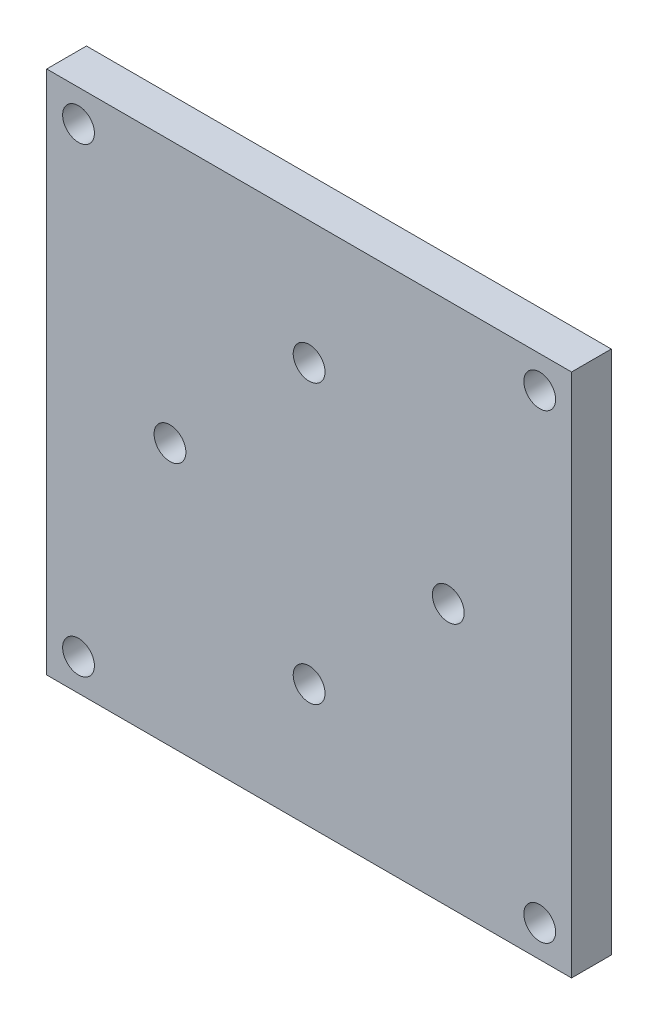
ISO-10303-21;
HEADER;
FILE_DESCRIPTION(('STEP AP214'),'2;1');
FILE_NAME('part.step','',(''),(''),'','','');
FILE_SCHEMA(('AUTOMOTIVE_DESIGN { 1 0 10303 214 1 1 1 1 }'));
ENDSEC;
DATA;
#1=APPLICATION_CONTEXT('core data for automotive mechanical design processes');
#2=APPLICATION_PROTOCOL_DEFINITION('international standard','automotive_design',2000,#1);
#3=PRODUCT_CONTEXT('',#1,'mechanical');
#4=PRODUCT('Part','Part','',(#3));
#5=PRODUCT_RELATED_PRODUCT_CATEGORY('part','',(#4));
#6=PRODUCT_DEFINITION_FORMATION('','',#4);
#7=PRODUCT_DEFINITION_CONTEXT('part definition',#1,'design');
#8=PRODUCT_DEFINITION('design','',#6,#7);
#9=PRODUCT_DEFINITION_SHAPE('','',#8);
#10=(LENGTH_UNIT() NAMED_UNIT(*) SI_UNIT(.MILLI.,.METRE.));
#11=(NAMED_UNIT(*) PLANE_ANGLE_UNIT() SI_UNIT($,.RADIAN.));
#12=(NAMED_UNIT(*) SI_UNIT($,.STERADIAN.) SOLID_ANGLE_UNIT());
#13=UNCERTAINTY_MEASURE_WITH_UNIT(LENGTH_MEASURE(1.E-05),#10,'distance_accuracy_value','');
#14=(GEOMETRIC_REPRESENTATION_CONTEXT(3) GLOBAL_UNCERTAINTY_ASSIGNED_CONTEXT((#13)) GLOBAL_UNIT_ASSIGNED_CONTEXT((#10,
#11,#12)) REPRESENTATION_CONTEXT('',''));
#15=CARTESIAN_POINT('',(0.,0.,0.));
#16=DIRECTION('',(0.,0.,1.));
#17=DIRECTION('',(1.,0.,0.));
#18=AXIS2_PLACEMENT_3D('',#15,#16,#17);
#19=CARTESIAN_POINT('',(33.,-33.,2.5));
#20=DIRECTION('',(-1.,0.,0.));
#21=DIRECTION('',(0.,0.,1.));
#22=AXIS2_PLACEMENT_3D('',#19,#20,#21);
#23=PLANE('',#22);
#24=DIRECTION('',(0.,1.,0.));
#25=VECTOR('',#24,1.);
#26=CARTESIAN_POINT('',(33.,-33.,-2.5));
#27=LINE('',#26,#25);
#28=CARTESIAN_POINT('',(33.,-33.,-2.5));
#29=VERTEX_POINT('',#28);
#30=CARTESIAN_POINT('',(33.,33.,-2.5));
#31=VERTEX_POINT('',#30);
#32=EDGE_CURVE('E107',#29,#31,#27,.T.);
#33=ORIENTED_EDGE('',*,*,#32,.T.);
#34=DIRECTION('',(0.,0.,-1.));
#35=VECTOR('',#34,1.);
#36=CARTESIAN_POINT('',(33.,33.,2.5));
#37=LINE('',#36,#35);
#38=CARTESIAN_POINT('',(33.,33.,2.5));
#39=VERTEX_POINT('',#38);
#40=EDGE_CURVE('E11',#39,#31,#37,.T.);
#41=ORIENTED_EDGE('',*,*,#40,.F.);
#42=DIRECTION('',(0.,1.,0.));
#43=VECTOR('',#42,1.);
#44=CARTESIAN_POINT('',(33.,-33.,2.5));
#45=LINE('',#44,#43);
#46=CARTESIAN_POINT('',(33.,-33.,2.5));
#47=VERTEX_POINT('',#46);
#48=EDGE_CURVE('E91',#47,#39,#45,.T.);
#49=ORIENTED_EDGE('',*,*,#48,.F.);
#50=DIRECTION('',(0.,0.,-1.));
#51=VECTOR('',#50,1.);
#52=CARTESIAN_POINT('',(33.,-33.,2.5));
#53=LINE('',#52,#51);
#54=EDGE_CURVE('E103',#47,#29,#53,.T.);
#55=ORIENTED_EDGE('',*,*,#54,.T.);
#56=EDGE_LOOP('',(#33,#41,#49,#55));
#57=FACE_BOUND('',#56,.T.);
#58=ADVANCED_FACE('F39',(#57),#23,.F.);
#59=CARTESIAN_POINT('',(-33.,33.,2.5));
#60=DIRECTION('',(0.,-1.,0.));
#61=DIRECTION('',(0.,0.,-1.));
#62=AXIS2_PLACEMENT_3D('',#59,#60,#61);
#63=PLANE('',#62);
#64=DIRECTION('',(-1.,0.,0.));
#65=VECTOR('',#64,1.);
#66=CARTESIAN_POINT('',(-33.,33.,-2.5));
#67=LINE('',#66,#65);
#68=CARTESIAN_POINT('',(-33.,33.,-2.5));
#69=VERTEX_POINT('',#68);
#70=EDGE_CURVE('E96',#31,#69,#67,.T.);
#71=ORIENTED_EDGE('',*,*,#70,.T.);
#72=DIRECTION('',(0.,0.,-1.));
#73=VECTOR('',#72,1.);
#74=CARTESIAN_POINT('',(-33.,33.,2.5));
#75=LINE('',#74,#73);
#76=CARTESIAN_POINT('',(-33.,33.,2.5));
#77=VERTEX_POINT('',#76);
#78=EDGE_CURVE('E48',#77,#69,#75,.T.);
#79=ORIENTED_EDGE('',*,*,#78,.F.);
#80=DIRECTION('',(-1.,0.,0.));
#81=VECTOR('',#80,1.);
#82=CARTESIAN_POINT('',(-33.,33.,2.5));
#83=LINE('',#82,#81);
#84=EDGE_CURVE('E86',#39,#77,#83,.T.);
#85=ORIENTED_EDGE('',*,*,#84,.F.);
#86=ORIENTED_EDGE('',*,*,#40,.T.);
#87=EDGE_LOOP('',(#71,#79,#85,#86));
#88=FACE_BOUND('',#87,.T.);
#89=ADVANCED_FACE('F95',(#88),#63,.F.);
#90=CARTESIAN_POINT('',(-33.,-33.,2.5));
#91=DIRECTION('',(1.,0.,0.));
#92=DIRECTION('',(0.,0.,-1.));
#93=AXIS2_PLACEMENT_3D('',#90,#91,#92);
#94=PLANE('',#93);
#95=DIRECTION('',(0.,-1.,0.));
#96=VECTOR('',#95,1.);
#97=CARTESIAN_POINT('',(-33.,-33.,-2.5));
#98=LINE('',#97,#96);
#99=CARTESIAN_POINT('',(-33.,-33.,-2.5));
#100=VERTEX_POINT('',#99);
#101=EDGE_CURVE('E73',#69,#100,#98,.T.);
#102=ORIENTED_EDGE('',*,*,#101,.T.);
#103=DIRECTION('',(0.,0.,-1.));
#104=VECTOR('',#103,1.);
#105=CARTESIAN_POINT('',(-33.,-33.,2.5));
#106=LINE('',#105,#104);
#107=CARTESIAN_POINT('',(-33.,-33.,2.5));
#108=VERTEX_POINT('',#107);
#109=EDGE_CURVE('E98',#108,#100,#106,.T.);
#110=ORIENTED_EDGE('',*,*,#109,.F.);
#111=DIRECTION('',(0.,-1.,0.));
#112=VECTOR('',#111,1.);
#113=CARTESIAN_POINT('',(-33.,-33.,2.5));
#114=LINE('',#113,#112);
#115=EDGE_CURVE('E89',#77,#108,#114,.T.);
#116=ORIENTED_EDGE('',*,*,#115,.F.);
#117=ORIENTED_EDGE('',*,*,#78,.T.);
#118=EDGE_LOOP('',(#102,#110,#116,#117));
#119=FACE_BOUND('',#118,.T.);
#120=ADVANCED_FACE('F99',(#119),#94,.F.);
#121=CARTESIAN_POINT('',(-33.,-33.,2.5));
#122=DIRECTION('',(0.,1.,0.));
#123=DIRECTION('',(0.,0.,1.));
#124=AXIS2_PLACEMENT_3D('',#121,#122,#123);
#125=PLANE('',#124);
#126=DIRECTION('',(1.,0.,0.));
#127=VECTOR('',#126,1.);
#128=CARTESIAN_POINT('',(-33.,-33.,-2.5));
#129=LINE('',#128,#127);
#130=EDGE_CURVE('E79',#100,#29,#129,.T.);
#131=ORIENTED_EDGE('',*,*,#130,.T.);
#132=ORIENTED_EDGE('',*,*,#54,.F.);
#133=DIRECTION('',(1.,0.,0.));
#134=VECTOR('',#133,1.);
#135=CARTESIAN_POINT('',(-33.,-33.,2.5));
#136=LINE('',#135,#134);
#137=EDGE_CURVE('E56',#108,#47,#136,.T.);
#138=ORIENTED_EDGE('',*,*,#137,.F.);
#139=ORIENTED_EDGE('',*,*,#109,.T.);
#140=EDGE_LOOP('',(#131,#132,#138,#139));
#141=FACE_BOUND('',#140,.T.);
#142=ADVANCED_FACE('F121',(#141),#125,.F.);
#143=CARTESIAN_POINT('',(0.,0.,2.5));
#144=DIRECTION('',(0.,0.,-1.));
#145=DIRECTION('',(-1.,0.,0.));
#146=AXIS2_PLACEMENT_3D('',#143,#144,#145);
#147=PLANE('',#146);
#148=CARTESIAN_POINT('',(0.,17.5,2.5));
#149=DIRECTION('',(0.,0.,1.));
#150=DIRECTION('',(1.,0.,0.));
#151=AXIS2_PLACEMENT_3D('',#148,#149,#150);
#152=CIRCLE('',#151,2.);
#153=CARTESIAN_POINT('',(2.,17.5,2.5));
#154=VERTEX_POINT('',#153);
#155=EDGE_CURVE('E184',#154,#154,#152,.T.);
#156=ORIENTED_EDGE('',*,*,#155,.F.);
#157=EDGE_LOOP('',(#156));
#158=FACE_BOUND('',#157,.T.);
#159=CARTESIAN_POINT('',(17.5,0.,2.5));
#160=DIRECTION('',(0.,0.,1.));
#161=DIRECTION('',(1.,0.,0.));
#162=AXIS2_PLACEMENT_3D('',#159,#160,#161);
#163=CIRCLE('',#162,2.);
#164=CARTESIAN_POINT('',(19.5,0.,2.5));
#165=VERTEX_POINT('',#164);
#166=EDGE_CURVE('E176',#165,#165,#163,.T.);
#167=ORIENTED_EDGE('',*,*,#166,.F.);
#168=EDGE_LOOP('',(#167));
#169=FACE_BOUND('',#168,.T.);
#170=CARTESIAN_POINT('',(0.,-17.5,2.5));
#171=DIRECTION('',(0.,0.,1.));
#172=DIRECTION('',(1.,0.,0.));
#173=AXIS2_PLACEMENT_3D('',#170,#171,#172);
#174=CIRCLE('',#173,2.);
#175=CARTESIAN_POINT('',(2.,-17.5,2.5));
#176=VERTEX_POINT('',#175);
#177=EDGE_CURVE('E168',#176,#176,#174,.T.);
#178=ORIENTED_EDGE('',*,*,#177,.F.);
#179=EDGE_LOOP('',(#178));
#180=FACE_BOUND('',#179,.T.);
#181=CARTESIAN_POINT('',(-17.5,0.,2.5));
#182=DIRECTION('',(0.,0.,1.));
#183=DIRECTION('',(1.,0.,0.));
#184=AXIS2_PLACEMENT_3D('',#181,#182,#183);
#185=CIRCLE('',#184,2.);
#186=CARTESIAN_POINT('',(-15.5,0.,2.5));
#187=VERTEX_POINT('',#186);
#188=EDGE_CURVE('E160',#187,#187,#185,.T.);
#189=ORIENTED_EDGE('',*,*,#188,.F.);
#190=EDGE_LOOP('',(#189));
#191=FACE_BOUND('',#190,.T.);
#192=CARTESIAN_POINT('',(-29.,-29.,2.5));
#193=DIRECTION('',(0.,0.,1.));
#194=DIRECTION('',(1.,0.,0.));
#195=AXIS2_PLACEMENT_3D('',#192,#193,#194);
#196=CIRCLE('',#195,2.);
#197=CARTESIAN_POINT('',(-27.,-29.,2.5));
#198=VERTEX_POINT('',#197);
#199=EDGE_CURVE('E136',#198,#198,#196,.T.);
#200=ORIENTED_EDGE('',*,*,#199,.F.);
#201=EDGE_LOOP('',(#200));
#202=FACE_BOUND('',#201,.T.);
#203=CARTESIAN_POINT('',(29.,-29.,2.5));
#204=DIRECTION('',(0.,0.,1.));
#205=DIRECTION('',(1.,0.,0.));
#206=AXIS2_PLACEMENT_3D('',#203,#204,#205);
#207=CIRCLE('',#206,2.00000000000001);
#208=CARTESIAN_POINT('',(31.,-29.,2.5));
#209=VERTEX_POINT('',#208);
#210=EDGE_CURVE('E145',#209,#209,#207,.T.);
#211=ORIENTED_EDGE('',*,*,#210,.F.);
#212=EDGE_LOOP('',(#211));
#213=FACE_BOUND('',#212,.T.);
#214=CARTESIAN_POINT('',(29.,29.,2.5));
#215=DIRECTION('',(0.,0.,1.));
#216=DIRECTION('',(1.,0.,0.));
#217=AXIS2_PLACEMENT_3D('',#214,#215,#216);
#218=CIRCLE('',#217,2.00000000000001);
#219=CARTESIAN_POINT('',(31.,29.,2.5));
#220=VERTEX_POINT('',#219);
#221=EDGE_CURVE('E153',#220,#220,#218,.T.);
#222=ORIENTED_EDGE('',*,*,#221,.F.);
#223=EDGE_LOOP('',(#222));
#224=FACE_BOUND('',#223,.T.);
#225=CARTESIAN_POINT('',(-29.,29.,2.5));
#226=DIRECTION('',(0.,0.,1.));
#227=DIRECTION('',(1.,0.,0.));
#228=AXIS2_PLACEMENT_3D('',#225,#226,#227);
#229=CIRCLE('',#228,2.);
#230=CARTESIAN_POINT('',(-27.,29.,2.5));
#231=VERTEX_POINT('',#230);
#232=EDGE_CURVE('E128',#231,#231,#229,.T.);
#233=ORIENTED_EDGE('',*,*,#232,.F.);
#234=EDGE_LOOP('',(#233));
#235=FACE_BOUND('',#234,.T.);
#236=ORIENTED_EDGE('',*,*,#48,.T.);
#237=ORIENTED_EDGE('',*,*,#84,.T.);
#238=ORIENTED_EDGE('',*,*,#115,.T.);
#239=ORIENTED_EDGE('',*,*,#137,.T.);
#240=EDGE_LOOP('',(#236,#237,#238,#239));
#241=FACE_BOUND('',#240,.T.);
#242=ADVANCED_FACE('F87',(#158,#169,#180,#191,#202,#213,#224,#235,#241),#147,.F.);
#243=CARTESIAN_POINT('',(0.,0.,-2.5));
#244=DIRECTION('',(0.,0.,-1.));
#245=DIRECTION('',(-1.,0.,0.));
#246=AXIS2_PLACEMENT_3D('',#243,#244,#245);
#247=PLANE('',#246);
#248=CARTESIAN_POINT('',(0.,17.5,-2.5));
#249=DIRECTION('',(0.,0.,1.));
#250=DIRECTION('',(1.,0.,0.));
#251=AXIS2_PLACEMENT_3D('',#248,#249,#250);
#252=CIRCLE('',#251,2.);
#253=CARTESIAN_POINT('',(2.,17.5,-2.5));
#254=VERTEX_POINT('',#253);
#255=EDGE_CURVE('E141',#254,#254,#252,.T.);
#256=ORIENTED_EDGE('',*,*,#255,.T.);
#257=EDGE_LOOP('',(#256));
#258=FACE_BOUND('',#257,.T.);
#259=CARTESIAN_POINT('',(17.5,0.,-2.5));
#260=DIRECTION('',(0.,0.,1.));
#261=DIRECTION('',(1.,0.,0.));
#262=AXIS2_PLACEMENT_3D('',#259,#260,#261);
#263=CIRCLE('',#262,2.);
#264=CARTESIAN_POINT('',(19.5,0.,-2.5));
#265=VERTEX_POINT('',#264);
#266=EDGE_CURVE('E180',#265,#265,#263,.T.);
#267=ORIENTED_EDGE('',*,*,#266,.T.);
#268=EDGE_LOOP('',(#267));
#269=FACE_BOUND('',#268,.T.);
#270=CARTESIAN_POINT('',(0.,-17.5,-2.5));
#271=DIRECTION('',(0.,0.,1.));
#272=DIRECTION('',(1.,0.,0.));
#273=AXIS2_PLACEMENT_3D('',#270,#271,#272);
#274=CIRCLE('',#273,2.);
#275=CARTESIAN_POINT('',(2.,-17.5,-2.5));
#276=VERTEX_POINT('',#275);
#277=EDGE_CURVE('E172',#276,#276,#274,.T.);
#278=ORIENTED_EDGE('',*,*,#277,.T.);
#279=EDGE_LOOP('',(#278));
#280=FACE_BOUND('',#279,.T.);
#281=CARTESIAN_POINT('',(-17.5,0.,-2.5));
#282=DIRECTION('',(0.,0.,1.));
#283=DIRECTION('',(1.,0.,0.));
#284=AXIS2_PLACEMENT_3D('',#281,#282,#283);
#285=CIRCLE('',#284,2.);
#286=CARTESIAN_POINT('',(-15.5,0.,-2.5));
#287=VERTEX_POINT('',#286);
#288=EDGE_CURVE('E164',#287,#287,#285,.T.);
#289=ORIENTED_EDGE('',*,*,#288,.T.);
#290=EDGE_LOOP('',(#289));
#291=FACE_BOUND('',#290,.T.);
#292=CARTESIAN_POINT('',(-29.,-29.,-2.5));
#293=DIRECTION('',(0.,0.,1.));
#294=DIRECTION('',(1.,0.,0.));
#295=AXIS2_PLACEMENT_3D('',#292,#293,#294);
#296=CIRCLE('',#295,2.);
#297=CARTESIAN_POINT('',(-27.,-29.,-2.5));
#298=VERTEX_POINT('',#297);
#299=EDGE_CURVE('E140',#298,#298,#296,.T.);
#300=ORIENTED_EDGE('',*,*,#299,.T.);
#301=EDGE_LOOP('',(#300));
#302=FACE_BOUND('',#301,.T.);
#303=CARTESIAN_POINT('',(29.,-29.,-2.5));
#304=DIRECTION('',(0.,0.,1.));
#305=DIRECTION('',(1.,0.,0.));
#306=AXIS2_PLACEMENT_3D('',#303,#304,#305);
#307=CIRCLE('',#306,2.00000000000001);
#308=CARTESIAN_POINT('',(31.,-29.,-2.5));
#309=VERTEX_POINT('',#308);
#310=EDGE_CURVE('E149',#309,#309,#307,.T.);
#311=ORIENTED_EDGE('',*,*,#310,.T.);
#312=EDGE_LOOP('',(#311));
#313=FACE_BOUND('',#312,.T.);
#314=CARTESIAN_POINT('',(29.,29.,-2.5));
#315=DIRECTION('',(0.,0.,1.));
#316=DIRECTION('',(1.,0.,0.));
#317=AXIS2_PLACEMENT_3D('',#314,#315,#316);
#318=CIRCLE('',#317,2.00000000000001);
#319=CARTESIAN_POINT('',(31.,29.,-2.5));
#320=VERTEX_POINT('',#319);
#321=EDGE_CURVE('E132',#320,#320,#318,.T.);
#322=ORIENTED_EDGE('',*,*,#321,.T.);
#323=EDGE_LOOP('',(#322));
#324=FACE_BOUND('',#323,.T.);
#325=CARTESIAN_POINT('',(-29.,29.,-2.5));
#326=DIRECTION('',(0.,0.,1.));
#327=DIRECTION('',(1.,0.,0.));
#328=AXIS2_PLACEMENT_3D('',#325,#326,#327);
#329=CIRCLE('',#328,2.);
#330=CARTESIAN_POINT('',(-27.,29.,-2.5));
#331=VERTEX_POINT('',#330);
#332=EDGE_CURVE('E111',#331,#331,#329,.T.);
#333=ORIENTED_EDGE('',*,*,#332,.T.);
#334=EDGE_LOOP('',(#333));
#335=FACE_BOUND('',#334,.T.);
#336=ORIENTED_EDGE('',*,*,#32,.F.);
#337=ORIENTED_EDGE('',*,*,#130,.F.);
#338=ORIENTED_EDGE('',*,*,#101,.F.);
#339=ORIENTED_EDGE('',*,*,#70,.F.);
#340=EDGE_LOOP('',(#336,#337,#338,#339));
#341=FACE_BOUND('',#340,.T.);
#342=ADVANCED_FACE('F124',(#258,#269,#280,#291,#302,#313,#324,#335,#341),#247,.T.);
#343=CARTESIAN_POINT('',(-29.,29.,-2.5));
#344=DIRECTION('',(0.,0.,1.));
#345=DIRECTION('',(1.,0.,0.));
#346=AXIS2_PLACEMENT_3D('',#343,#344,#345);
#347=CYLINDRICAL_SURFACE('',#346,2.);
#348=ORIENTED_EDGE('',*,*,#332,.F.);
#349=EDGE_LOOP('',(#348));
#350=FACE_BOUND('',#349,.T.);
#351=ORIENTED_EDGE('',*,*,#232,.T.);
#352=EDGE_LOOP('',(#351));
#353=FACE_BOUND('',#352,.T.);
#354=ADVANCED_FACE('F218',(#350,#353),#347,.F.);
#355=CARTESIAN_POINT('',(29.,29.,-2.5));
#356=DIRECTION('',(0.,0.,1.));
#357=DIRECTION('',(1.,0.,0.));
#358=AXIS2_PLACEMENT_3D('',#355,#356,#357);
#359=CYLINDRICAL_SURFACE('',#358,2.00000000000001);
#360=ORIENTED_EDGE('',*,*,#321,.F.);
#361=EDGE_LOOP('',(#360));
#362=FACE_BOUND('',#361,.T.);
#363=ORIENTED_EDGE('',*,*,#221,.T.);
#364=EDGE_LOOP('',(#363));
#365=FACE_BOUND('',#364,.T.);
#366=ADVANCED_FACE('F220',(#362,#365),#359,.F.);
#367=CARTESIAN_POINT('',(29.,-29.,-2.5));
#368=DIRECTION('',(0.,0.,1.));
#369=DIRECTION('',(1.,0.,0.));
#370=AXIS2_PLACEMENT_3D('',#367,#368,#369);
#371=CYLINDRICAL_SURFACE('',#370,2.00000000000001);
#372=ORIENTED_EDGE('',*,*,#310,.F.);
#373=EDGE_LOOP('',(#372));
#374=FACE_BOUND('',#373,.T.);
#375=ORIENTED_EDGE('',*,*,#210,.T.);
#376=EDGE_LOOP('',(#375));
#377=FACE_BOUND('',#376,.T.);
#378=ADVANCED_FACE('F227',(#374,#377),#371,.F.);
#379=CARTESIAN_POINT('',(-29.,-29.,-2.5));
#380=DIRECTION('',(0.,0.,1.));
#381=DIRECTION('',(1.,0.,0.));
#382=AXIS2_PLACEMENT_3D('',#379,#380,#381);
#383=CYLINDRICAL_SURFACE('',#382,2.);
#384=ORIENTED_EDGE('',*,*,#299,.F.);
#385=EDGE_LOOP('',(#384));
#386=FACE_BOUND('',#385,.T.);
#387=ORIENTED_EDGE('',*,*,#199,.T.);
#388=EDGE_LOOP('',(#387));
#389=FACE_BOUND('',#388,.T.);
#390=ADVANCED_FACE('F268',(#386,#389),#383,.F.);
#391=CARTESIAN_POINT('',(-17.5,0.,-2.5));
#392=DIRECTION('',(0.,0.,1.));
#393=DIRECTION('',(1.,0.,0.));
#394=AXIS2_PLACEMENT_3D('',#391,#392,#393);
#395=CYLINDRICAL_SURFACE('',#394,2.);
#396=ORIENTED_EDGE('',*,*,#288,.F.);
#397=EDGE_LOOP('',(#396));
#398=FACE_BOUND('',#397,.T.);
#399=ORIENTED_EDGE('',*,*,#188,.T.);
#400=EDGE_LOOP('',(#399));
#401=FACE_BOUND('',#400,.T.);
#402=ADVANCED_FACE('F262',(#398,#401),#395,.F.);
#403=CARTESIAN_POINT('',(0.,-17.5,-2.5));
#404=DIRECTION('',(0.,0.,1.));
#405=DIRECTION('',(1.,0.,0.));
#406=AXIS2_PLACEMENT_3D('',#403,#404,#405);
#407=CYLINDRICAL_SURFACE('',#406,2.);
#408=ORIENTED_EDGE('',*,*,#277,.F.);
#409=EDGE_LOOP('',(#408));
#410=FACE_BOUND('',#409,.T.);
#411=ORIENTED_EDGE('',*,*,#177,.T.);
#412=EDGE_LOOP('',(#411));
#413=FACE_BOUND('',#412,.T.);
#414=ADVANCED_FACE('F267',(#410,#413),#407,.F.);
#415=CARTESIAN_POINT('',(17.5,0.,-2.5));
#416=DIRECTION('',(0.,0.,1.));
#417=DIRECTION('',(1.,0.,0.));
#418=AXIS2_PLACEMENT_3D('',#415,#416,#417);
#419=CYLINDRICAL_SURFACE('',#418,2.);
#420=ORIENTED_EDGE('',*,*,#266,.F.);
#421=EDGE_LOOP('',(#420));
#422=FACE_BOUND('',#421,.T.);
#423=ORIENTED_EDGE('',*,*,#166,.T.);
#424=EDGE_LOOP('',(#423));
#425=FACE_BOUND('',#424,.T.);
#426=ADVANCED_FACE('F197',(#422,#425),#419,.F.);
#427=CARTESIAN_POINT('',(0.,17.5,-2.5));
#428=DIRECTION('',(0.,0.,1.));
#429=DIRECTION('',(1.,0.,0.));
#430=AXIS2_PLACEMENT_3D('',#427,#428,#429);
#431=CYLINDRICAL_SURFACE('',#430,2.);
#432=ORIENTED_EDGE('',*,*,#255,.F.);
#433=EDGE_LOOP('',(#432));
#434=FACE_BOUND('',#433,.T.);
#435=ORIENTED_EDGE('',*,*,#155,.T.);
#436=EDGE_LOOP('',(#435));
#437=FACE_BOUND('',#436,.T.);
#438=ADVANCED_FACE('F194',(#434,#437),#431,.F.);
#439=CLOSED_SHELL('',(#58,#89,#120,#142,#242,#342,#354,#366,#378,#390,#402,#414,#426,#438));
#440=MANIFOLD_SOLID_BREP('B2',#439);
#441=ADVANCED_BREP_SHAPE_REPRESENTATION('',(#18,#440),#14);
#442=SHAPE_DEFINITION_REPRESENTATION(#9,#441);
ENDSEC;
END-ISO-10303-21;
